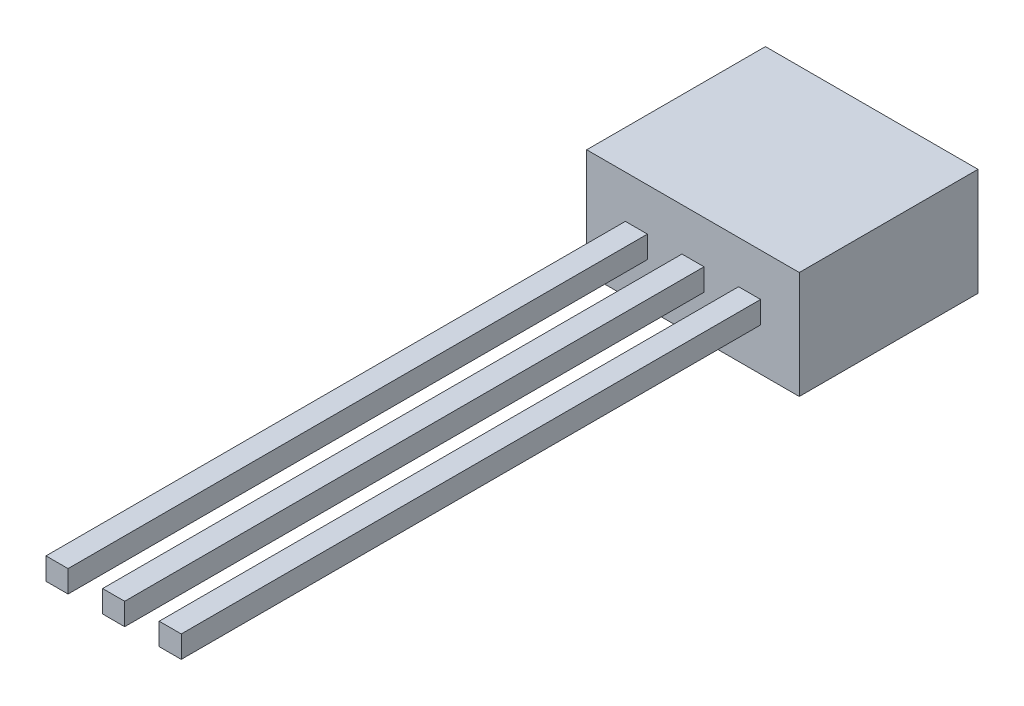
ISO-10303-21;
HEADER;
FILE_DESCRIPTION(('STEP AP214'),'2;1');
FILE_NAME('part.step','',(''),(''),'','','');
FILE_SCHEMA(('AUTOMOTIVE_DESIGN { 1 0 10303 214 1 1 1 1 }'));
ENDSEC;
DATA;
#1=APPLICATION_CONTEXT('core data for automotive mechanical design processes');
#2=APPLICATION_PROTOCOL_DEFINITION('international standard','automotive_design',2000,#1);
#3=PRODUCT_CONTEXT('',#1,'mechanical');
#4=PRODUCT('Part','Part','',(#3));
#5=PRODUCT_RELATED_PRODUCT_CATEGORY('part','',(#4));
#6=PRODUCT_DEFINITION_FORMATION('','',#4);
#7=PRODUCT_DEFINITION_CONTEXT('part definition',#1,'design');
#8=PRODUCT_DEFINITION('design','',#6,#7);
#9=PRODUCT_DEFINITION_SHAPE('','',#8);
#10=(LENGTH_UNIT() NAMED_UNIT(*) SI_UNIT(.MILLI.,.METRE.));
#11=(NAMED_UNIT(*) PLANE_ANGLE_UNIT() SI_UNIT($,.RADIAN.));
#12=(NAMED_UNIT(*) SI_UNIT($,.STERADIAN.) SOLID_ANGLE_UNIT());
#13=UNCERTAINTY_MEASURE_WITH_UNIT(LENGTH_MEASURE(1.E-05),#10,'distance_accuracy_value','');
#14=(GEOMETRIC_REPRESENTATION_CONTEXT(3) GLOBAL_UNCERTAINTY_ASSIGNED_CONTEXT((#13)) GLOBAL_UNIT_ASSIGNED_CONTEXT((#10,
#11,#12)) REPRESENTATION_CONTEXT('',''));
#15=CARTESIAN_POINT('',(0.,0.,0.));
#16=DIRECTION('',(0.,0.,1.));
#17=DIRECTION('',(1.,0.,0.));
#18=AXIS2_PLACEMENT_3D('',#15,#16,#17);
#19=CARTESIAN_POINT('',(0.,2.41,4.01));
#20=DIRECTION('',(0.,0.,-1.));
#21=DIRECTION('',(-1.,0.,0.));
#22=AXIS2_PLACEMENT_3D('',#19,#20,#21);
#23=PLANE('',#22);
#24=DIRECTION('',(1.,0.,0.));
#25=VECTOR('',#24,1.);
#26=CARTESIAN_POINT('',(3.4075,0.9575,4.01));
#27=LINE('',#26,#25);
#28=CARTESIAN_POINT('',(3.4075,0.9575,4.01));
#29=VERTEX_POINT('',#28);
#30=CARTESIAN_POINT('',(3.9025,0.9575,4.01));
#31=VERTEX_POINT('',#30);
#32=EDGE_CURVE('E170',#29,#31,#27,.T.);
#33=ORIENTED_EDGE('',*,*,#32,.F.);
#34=DIRECTION('',(0.,-1.,0.));
#35=VECTOR('',#34,1.);
#36=CARTESIAN_POINT('',(3.4075,1.4525,4.01));
#37=LINE('',#36,#35);
#38=CARTESIAN_POINT('',(3.4075,1.4525,4.01));
#39=VERTEX_POINT('',#38);
#40=EDGE_CURVE('E183',#39,#29,#37,.T.);
#41=ORIENTED_EDGE('',*,*,#40,.F.);
#42=DIRECTION('',(-1.,0.,0.));
#43=VECTOR('',#42,1.);
#44=CARTESIAN_POINT('',(3.4075,1.4525,4.01));
#45=LINE('',#44,#43);
#46=CARTESIAN_POINT('',(3.9025,1.4525,4.01));
#47=VERTEX_POINT('',#46);
#48=EDGE_CURVE('E192',#47,#39,#45,.T.);
#49=ORIENTED_EDGE('',*,*,#48,.F.);
#50=DIRECTION('',(0.,1.,0.));
#51=VECTOR('',#50,1.);
#52=CARTESIAN_POINT('',(3.9025,1.4525,4.01));
#53=LINE('',#52,#51);
#54=EDGE_CURVE('E173',#31,#47,#53,.T.);
#55=ORIENTED_EDGE('',*,*,#54,.F.);
#56=EDGE_LOOP('',(#33,#41,#49,#55));
#57=FACE_BOUND('',#56,.T.);
#58=DIRECTION('',(1.,0.,0.));
#59=VECTOR('',#58,1.);
#60=CARTESIAN_POINT('',(0.,0.,4.01));
#61=LINE('',#60,#59);
#62=CARTESIAN_POINT('',(0.,0.,4.01));
#63=VERTEX_POINT('',#62);
#64=CARTESIAN_POINT('',(4.77,0.,4.01));
#65=VERTEX_POINT('',#64);
#66=EDGE_CURVE('E255',#63,#65,#61,.T.);
#67=ORIENTED_EDGE('',*,*,#66,.T.);
#68=DIRECTION('',(0.,-1.,0.));
#69=VECTOR('',#68,1.);
#70=CARTESIAN_POINT('',(4.77,2.41,4.01));
#71=LINE('',#70,#69);
#72=CARTESIAN_POINT('',(4.77,2.41,4.01));
#73=VERTEX_POINT('',#72);
#74=EDGE_CURVE('E44',#73,#65,#71,.T.);
#75=ORIENTED_EDGE('',*,*,#74,.F.);
#76=DIRECTION('',(1.,0.,0.));
#77=VECTOR('',#76,1.);
#78=CARTESIAN_POINT('',(0.,2.41,4.01));
#79=LINE('',#78,#77);
#80=CARTESIAN_POINT('',(0.,2.41,4.01));
#81=VERTEX_POINT('',#80);
#82=EDGE_CURVE('E245',#81,#73,#79,.T.);
#83=ORIENTED_EDGE('',*,*,#82,.F.);
#84=DIRECTION('',(0.,-1.,0.));
#85=VECTOR('',#84,1.);
#86=CARTESIAN_POINT('',(0.,2.41,4.01));
#87=LINE('',#86,#85);
#88=EDGE_CURVE('E11',#81,#63,#87,.T.);
#89=ORIENTED_EDGE('',*,*,#88,.T.);
#90=EDGE_LOOP('',(#67,#75,#83,#89));
#91=FACE_BOUND('',#90,.T.);
#92=DIRECTION('',(0.,1.,0.));
#93=VECTOR('',#92,1.);
#94=CARTESIAN_POINT('',(2.6325,1.4525,4.01));
#95=LINE('',#94,#93);
#96=CARTESIAN_POINT('',(2.6325,0.9575,4.01));
#97=VERTEX_POINT('',#96);
#98=CARTESIAN_POINT('',(2.6325,1.4525,4.01));
#99=VERTEX_POINT('',#98);
#100=EDGE_CURVE('E208',#97,#99,#95,.T.);
#101=ORIENTED_EDGE('',*,*,#100,.F.);
#102=DIRECTION('',(1.,0.,0.));
#103=VECTOR('',#102,1.);
#104=CARTESIAN_POINT('',(2.1375,0.9575,4.01));
#105=LINE('',#104,#103);
#106=CARTESIAN_POINT('',(2.1375,0.9575,4.01));
#107=VERTEX_POINT('',#106);
#108=EDGE_CURVE('E213',#107,#97,#105,.T.);
#109=ORIENTED_EDGE('',*,*,#108,.F.);
#110=DIRECTION('',(0.,-1.,0.));
#111=VECTOR('',#110,1.);
#112=CARTESIAN_POINT('',(2.1375,1.4525,4.01));
#113=LINE('',#112,#111);
#114=CARTESIAN_POINT('',(2.1375,1.4525,4.01));
#115=VERTEX_POINT('',#114);
#116=EDGE_CURVE('E225',#115,#107,#113,.T.);
#117=ORIENTED_EDGE('',*,*,#116,.F.);
#118=DIRECTION('',(-1.,0.,0.));
#119=VECTOR('',#118,1.);
#120=CARTESIAN_POINT('',(2.1375,1.4525,4.01));
#121=LINE('',#120,#119);
#122=EDGE_CURVE('E222',#99,#115,#121,.T.);
#123=ORIENTED_EDGE('',*,*,#122,.F.);
#124=EDGE_LOOP('',(#101,#109,#117,#123));
#125=FACE_BOUND('',#124,.T.);
#126=DIRECTION('',(1.,0.,0.));
#127=VECTOR('',#126,1.);
#128=CARTESIAN_POINT('',(0.867500000000001,0.957499999999991,4.01));
#129=LINE('',#128,#127);
#130=CARTESIAN_POINT('',(0.867500000000001,0.957499999999991,4.01));
#131=VERTEX_POINT('',#130);
#132=CARTESIAN_POINT('',(1.3625,0.957499999999991,4.01));
#133=VERTEX_POINT('',#132);
#134=EDGE_CURVE('E169',#131,#133,#129,.T.);
#135=ORIENTED_EDGE('',*,*,#134,.F.);
#136=DIRECTION('',(0.,-1.,0.));
#137=VECTOR('',#136,1.);
#138=CARTESIAN_POINT('',(0.867500000000001,1.45249999999999,4.01));
#139=LINE('',#138,#137);
#140=CARTESIAN_POINT('',(0.867500000000001,1.45249999999999,4.01));
#141=VERTEX_POINT('',#140);
#142=EDGE_CURVE('E166',#141,#131,#139,.T.);
#143=ORIENTED_EDGE('',*,*,#142,.F.);
#144=DIRECTION('',(-1.,0.,0.));
#145=VECTOR('',#144,1.);
#146=CARTESIAN_POINT('',(0.867500000000001,1.45249999999999,4.01));
#147=LINE('',#146,#145);
#148=CARTESIAN_POINT('',(1.3625,1.45249999999999,4.01));
#149=VERTEX_POINT('',#148);
#150=EDGE_CURVE('E56',#149,#141,#147,.T.);
#151=ORIENTED_EDGE('',*,*,#150,.F.);
#152=DIRECTION('',(0.,1.,0.));
#153=VECTOR('',#152,1.);
#154=CARTESIAN_POINT('',(1.3625,1.45249999999999,4.01));
#155=LINE('',#154,#153);
#156=EDGE_CURVE('E51',#133,#149,#155,.T.);
#157=ORIENTED_EDGE('',*,*,#156,.F.);
#158=EDGE_LOOP('',(#135,#143,#151,#157));
#159=FACE_BOUND('',#158,.T.);
#160=ADVANCED_FACE('F36',(#57,#91,#125,#159),#23,.F.);
#161=CARTESIAN_POINT('',(0.,2.41,0.));
#162=DIRECTION('',(1.,0.,0.));
#163=DIRECTION('',(0.,0.,-1.));
#164=AXIS2_PLACEMENT_3D('',#161,#162,#163);
#165=PLANE('',#164);
#166=DIRECTION('',(0.,0.,1.));
#167=VECTOR('',#166,1.);
#168=CARTESIAN_POINT('',(0.,0.,0.));
#169=LINE('',#168,#167);
#170=CARTESIAN_POINT('',(0.,0.,0.));
#171=VERTEX_POINT('',#170);
#172=EDGE_CURVE('E241',#171,#63,#169,.T.);
#173=ORIENTED_EDGE('',*,*,#172,.T.);
#174=ORIENTED_EDGE('',*,*,#88,.F.);
#175=DIRECTION('',(0.,0.,1.));
#176=VECTOR('',#175,1.);
#177=CARTESIAN_POINT('',(0.,2.41,0.));
#178=LINE('',#177,#176);
#179=CARTESIAN_POINT('',(0.,2.41,0.));
#180=VERTEX_POINT('',#179);
#181=EDGE_CURVE('E242',#180,#81,#178,.T.);
#182=ORIENTED_EDGE('',*,*,#181,.F.);
#183=DIRECTION('',(0.,-1.,0.));
#184=VECTOR('',#183,1.);
#185=CARTESIAN_POINT('',(0.,2.41,0.));
#186=LINE('',#185,#184);
#187=EDGE_CURVE('E252',#180,#171,#186,.T.);
#188=ORIENTED_EDGE('',*,*,#187,.T.);
#189=EDGE_LOOP('',(#173,#174,#182,#188));
#190=FACE_BOUND('',#189,.T.);
#191=ADVANCED_FACE('F38',(#190),#165,.F.);
#192=CARTESIAN_POINT('',(4.77,2.41,0.));
#193=DIRECTION('',(-1.,0.,0.));
#194=DIRECTION('',(0.,0.,1.));
#195=AXIS2_PLACEMENT_3D('',#192,#193,#194);
#196=PLANE('',#195);
#197=DIRECTION('',(0.,0.,-1.));
#198=VECTOR('',#197,1.);
#199=CARTESIAN_POINT('',(4.77,0.,0.));
#200=LINE('',#199,#198);
#201=CARTESIAN_POINT('',(4.77,0.,0.));
#202=VERTEX_POINT('',#201);
#203=EDGE_CURVE('E257',#65,#202,#200,.T.);
#204=ORIENTED_EDGE('',*,*,#203,.T.);
#205=DIRECTION('',(0.,-1.,0.));
#206=VECTOR('',#205,1.);
#207=CARTESIAN_POINT('',(4.77,2.41,0.));
#208=LINE('',#207,#206);
#209=CARTESIAN_POINT('',(4.77,2.41,0.));
#210=VERTEX_POINT('',#209);
#211=EDGE_CURVE('E262',#210,#202,#208,.T.);
#212=ORIENTED_EDGE('',*,*,#211,.F.);
#213=DIRECTION('',(0.,0.,-1.));
#214=VECTOR('',#213,1.);
#215=CARTESIAN_POINT('',(4.77,2.41,0.));
#216=LINE('',#215,#214);
#217=EDGE_CURVE('E248',#73,#210,#216,.T.);
#218=ORIENTED_EDGE('',*,*,#217,.F.);
#219=ORIENTED_EDGE('',*,*,#74,.T.);
#220=EDGE_LOOP('',(#204,#212,#218,#219));
#221=FACE_BOUND('',#220,.T.);
#222=ADVANCED_FACE('F269',(#221),#196,.F.);
#223=CARTESIAN_POINT('',(0.,2.41,0.));
#224=DIRECTION('',(0.,0.,1.));
#225=DIRECTION('',(1.,0.,0.));
#226=AXIS2_PLACEMENT_3D('',#223,#224,#225);
#227=PLANE('',#226);
#228=DIRECTION('',(-1.,0.,0.));
#229=VECTOR('',#228,1.);
#230=CARTESIAN_POINT('',(0.,0.,0.));
#231=LINE('',#230,#229);
#232=EDGE_CURVE('E246',#202,#171,#231,.T.);
#233=ORIENTED_EDGE('',*,*,#232,.T.);
#234=ORIENTED_EDGE('',*,*,#187,.F.);
#235=DIRECTION('',(-1.,0.,0.));
#236=VECTOR('',#235,1.);
#237=CARTESIAN_POINT('',(0.,2.41,0.));
#238=LINE('',#237,#236);
#239=EDGE_CURVE('E250',#210,#180,#238,.T.);
#240=ORIENTED_EDGE('',*,*,#239,.F.);
#241=ORIENTED_EDGE('',*,*,#211,.T.);
#242=EDGE_LOOP('',(#233,#234,#240,#241));
#243=FACE_BOUND('',#242,.T.);
#244=ADVANCED_FACE('F278',(#243),#227,.F.);
#245=CARTESIAN_POINT('',(0.,2.41,0.));
#246=DIRECTION('',(0.,1.,0.));
#247=DIRECTION('',(0.,0.,1.));
#248=AXIS2_PLACEMENT_3D('',#245,#246,#247);
#249=PLANE('',#248);
#250=ORIENTED_EDGE('',*,*,#181,.T.);
#251=ORIENTED_EDGE('',*,*,#82,.T.);
#252=ORIENTED_EDGE('',*,*,#217,.T.);
#253=ORIENTED_EDGE('',*,*,#239,.T.);
#254=EDGE_LOOP('',(#250,#251,#252,#253));
#255=FACE_BOUND('',#254,.T.);
#256=ADVANCED_FACE('F284',(#255),#249,.T.);
#257=CARTESIAN_POINT('',(0.,0.,0.));
#258=DIRECTION('',(0.,1.,0.));
#259=DIRECTION('',(0.,0.,1.));
#260=AXIS2_PLACEMENT_3D('',#257,#258,#259);
#261=PLANE('',#260);
#262=ORIENTED_EDGE('',*,*,#172,.F.);
#263=ORIENTED_EDGE('',*,*,#232,.F.);
#264=ORIENTED_EDGE('',*,*,#203,.F.);
#265=ORIENTED_EDGE('',*,*,#66,.F.);
#266=EDGE_LOOP('',(#262,#263,#264,#265));
#267=FACE_BOUND('',#266,.T.);
#268=ADVANCED_FACE('F275',(#267),#261,.F.);
#269=CARTESIAN_POINT('',(2.6325,1.4525,17.01));
#270=DIRECTION('',(-1.,0.,0.));
#271=DIRECTION('',(0.,0.,1.));
#272=AXIS2_PLACEMENT_3D('',#269,#270,#271);
#273=PLANE('',#272);
#274=ORIENTED_EDGE('',*,*,#100,.T.);
#275=DIRECTION('',(0.,0.,-1.));
#276=VECTOR('',#275,1.);
#277=CARTESIAN_POINT('',(2.6325,1.4525,17.01));
#278=LINE('',#277,#276);
#279=CARTESIAN_POINT('',(2.6325,1.4525,17.01));
#280=VERTEX_POINT('',#279);
#281=EDGE_CURVE('E238',#280,#99,#278,.T.);
#282=ORIENTED_EDGE('',*,*,#281,.F.);
#283=DIRECTION('',(0.,1.,0.));
#284=VECTOR('',#283,1.);
#285=CARTESIAN_POINT('',(2.6325,1.4525,17.01));
#286=LINE('',#285,#284);
#287=CARTESIAN_POINT('',(2.6325,0.9575,17.01));
#288=VERTEX_POINT('',#287);
#289=EDGE_CURVE('E209',#288,#280,#286,.T.);
#290=ORIENTED_EDGE('',*,*,#289,.F.);
#291=DIRECTION('',(0.,0.,-1.));
#292=VECTOR('',#291,1.);
#293=CARTESIAN_POINT('',(2.6325,0.9575,17.01));
#294=LINE('',#293,#292);
#295=EDGE_CURVE('E219',#288,#97,#294,.T.);
#296=ORIENTED_EDGE('',*,*,#295,.T.);
#297=EDGE_LOOP('',(#274,#282,#290,#296));
#298=FACE_BOUND('',#297,.T.);
#299=ADVANCED_FACE('F350',(#298),#273,.F.);
#300=CARTESIAN_POINT('',(2.1375,1.4525,17.01));
#301=DIRECTION('',(0.,-1.,0.));
#302=DIRECTION('',(0.,0.,-1.));
#303=AXIS2_PLACEMENT_3D('',#300,#301,#302);
#304=PLANE('',#303);
#305=ORIENTED_EDGE('',*,*,#122,.T.);
#306=DIRECTION('',(0.,0.,-1.));
#307=VECTOR('',#306,1.);
#308=CARTESIAN_POINT('',(2.1375,1.4525,17.01));
#309=LINE('',#308,#307);
#310=CARTESIAN_POINT('',(2.1375,1.4525,17.01));
#311=VERTEX_POINT('',#310);
#312=EDGE_CURVE('E235',#311,#115,#309,.T.);
#313=ORIENTED_EDGE('',*,*,#312,.F.);
#314=DIRECTION('',(-1.,0.,0.));
#315=VECTOR('',#314,1.);
#316=CARTESIAN_POINT('',(2.1375,1.4525,17.01));
#317=LINE('',#316,#315);
#318=EDGE_CURVE('E212',#280,#311,#317,.T.);
#319=ORIENTED_EDGE('',*,*,#318,.F.);
#320=ORIENTED_EDGE('',*,*,#281,.T.);
#321=EDGE_LOOP('',(#305,#313,#319,#320));
#322=FACE_BOUND('',#321,.T.);
#323=ADVANCED_FACE('F346',(#322),#304,.F.);
#324=CARTESIAN_POINT('',(2.1375,1.4525,17.01));
#325=DIRECTION('',(1.,0.,0.));
#326=DIRECTION('',(0.,0.,-1.));
#327=AXIS2_PLACEMENT_3D('',#324,#325,#326);
#328=PLANE('',#327);
#329=ORIENTED_EDGE('',*,*,#116,.T.);
#330=DIRECTION('',(0.,0.,-1.));
#331=VECTOR('',#330,1.);
#332=CARTESIAN_POINT('',(2.1375,0.9575,17.01));
#333=LINE('',#332,#331);
#334=CARTESIAN_POINT('',(2.1375,0.9575,17.01));
#335=VERTEX_POINT('',#334);
#336=EDGE_CURVE('E232',#335,#107,#333,.T.);
#337=ORIENTED_EDGE('',*,*,#336,.F.);
#338=DIRECTION('',(0.,-1.,0.));
#339=VECTOR('',#338,1.);
#340=CARTESIAN_POINT('',(2.1375,1.4525,17.01));
#341=LINE('',#340,#339);
#342=EDGE_CURVE('E215',#311,#335,#341,.T.);
#343=ORIENTED_EDGE('',*,*,#342,.F.);
#344=ORIENTED_EDGE('',*,*,#312,.T.);
#345=EDGE_LOOP('',(#329,#337,#343,#344));
#346=FACE_BOUND('',#345,.T.);
#347=ADVANCED_FACE('F342',(#346),#328,.F.);
#348=CARTESIAN_POINT('',(2.1375,0.9575,17.01));
#349=DIRECTION('',(0.,1.,0.));
#350=DIRECTION('',(0.,0.,1.));
#351=AXIS2_PLACEMENT_3D('',#348,#349,#350);
#352=PLANE('',#351);
#353=ORIENTED_EDGE('',*,*,#108,.T.);
#354=ORIENTED_EDGE('',*,*,#295,.F.);
#355=DIRECTION('',(1.,0.,0.));
#356=VECTOR('',#355,1.);
#357=CARTESIAN_POINT('',(2.1375,0.9575,17.01));
#358=LINE('',#357,#356);
#359=EDGE_CURVE('E217',#335,#288,#358,.T.);
#360=ORIENTED_EDGE('',*,*,#359,.F.);
#361=ORIENTED_EDGE('',*,*,#336,.T.);
#362=EDGE_LOOP('',(#353,#354,#360,#361));
#363=FACE_BOUND('',#362,.T.);
#364=ADVANCED_FACE('F338',(#363),#352,.F.);
#365=CARTESIAN_POINT('',(0.,0.,17.01));
#366=DIRECTION('',(0.,0.,1.));
#367=DIRECTION('',(1.,0.,0.));
#368=AXIS2_PLACEMENT_3D('',#365,#366,#367);
#369=PLANE('',#368);
#370=ORIENTED_EDGE('',*,*,#289,.T.);
#371=ORIENTED_EDGE('',*,*,#318,.T.);
#372=ORIENTED_EDGE('',*,*,#342,.T.);
#373=ORIENTED_EDGE('',*,*,#359,.T.);
#374=EDGE_LOOP('',(#370,#371,#372,#373));
#375=FACE_BOUND('',#374,.T.);
#376=ADVANCED_FACE('F334',(#375),#369,.T.);
#377=CARTESIAN_POINT('',(3.4075,0.9575,17.01));
#378=DIRECTION('',(0.,1.,0.));
#379=DIRECTION('',(0.,0.,1.));
#380=AXIS2_PLACEMENT_3D('',#377,#378,#379);
#381=PLANE('',#380);
#382=ORIENTED_EDGE('',*,*,#32,.T.);
#383=DIRECTION('',(0.,0.,-1.));
#384=VECTOR('',#383,1.);
#385=CARTESIAN_POINT('',(3.9025,0.9575,17.01));
#386=LINE('',#385,#384);
#387=CARTESIAN_POINT('',(3.9025,0.9575,17.01));
#388=VERTEX_POINT('',#387);
#389=EDGE_CURVE('E205',#388,#31,#386,.T.);
#390=ORIENTED_EDGE('',*,*,#389,.F.);
#391=DIRECTION('',(1.,0.,0.));
#392=VECTOR('',#391,1.);
#393=CARTESIAN_POINT('',(3.4075,0.9575,17.01));
#394=LINE('',#393,#392);
#395=CARTESIAN_POINT('',(3.4075,0.9575,17.01));
#396=VERTEX_POINT('',#395);
#397=EDGE_CURVE('E179',#396,#388,#394,.T.);
#398=ORIENTED_EDGE('',*,*,#397,.F.);
#399=DIRECTION('',(0.,0.,-1.));
#400=VECTOR('',#399,1.);
#401=CARTESIAN_POINT('',(3.4075,0.9575,17.01));
#402=LINE('',#401,#400);
#403=EDGE_CURVE('E188',#396,#29,#402,.T.);
#404=ORIENTED_EDGE('',*,*,#403,.T.);
#405=EDGE_LOOP('',(#382,#390,#398,#404));
#406=FACE_BOUND('',#405,.T.);
#407=ADVANCED_FACE('F330',(#406),#381,.F.);
#408=CARTESIAN_POINT('',(3.9025,1.4525,17.01));
#409=DIRECTION('',(-1.,0.,0.));
#410=DIRECTION('',(0.,0.,1.));
#411=AXIS2_PLACEMENT_3D('',#408,#409,#410);
#412=PLANE('',#411);
#413=ORIENTED_EDGE('',*,*,#54,.T.);
#414=DIRECTION('',(0.,0.,-1.));
#415=VECTOR('',#414,1.);
#416=CARTESIAN_POINT('',(3.9025,1.4525,17.01));
#417=LINE('',#416,#415);
#418=CARTESIAN_POINT('',(3.9025,1.4525,17.01));
#419=VERTEX_POINT('',#418);
#420=EDGE_CURVE('E202',#419,#47,#417,.T.);
#421=ORIENTED_EDGE('',*,*,#420,.F.);
#422=DIRECTION('',(0.,1.,0.));
#423=VECTOR('',#422,1.);
#424=CARTESIAN_POINT('',(3.9025,1.4525,17.01));
#425=LINE('',#424,#423);
#426=EDGE_CURVE('E182',#388,#419,#425,.T.);
#427=ORIENTED_EDGE('',*,*,#426,.F.);
#428=ORIENTED_EDGE('',*,*,#389,.T.);
#429=EDGE_LOOP('',(#413,#421,#427,#428));
#430=FACE_BOUND('',#429,.T.);
#431=ADVANCED_FACE('F326',(#430),#412,.F.);
#432=CARTESIAN_POINT('',(3.4075,1.4525,17.01));
#433=DIRECTION('',(0.,-1.,0.));
#434=DIRECTION('',(0.,0.,-1.));
#435=AXIS2_PLACEMENT_3D('',#432,#433,#434);
#436=PLANE('',#435);
#437=ORIENTED_EDGE('',*,*,#48,.T.);
#438=DIRECTION('',(0.,0.,-1.));
#439=VECTOR('',#438,1.);
#440=CARTESIAN_POINT('',(3.4075,1.4525,17.01));
#441=LINE('',#440,#439);
#442=CARTESIAN_POINT('',(3.4075,1.4525,17.01));
#443=VERTEX_POINT('',#442);
#444=EDGE_CURVE('E199',#443,#39,#441,.T.);
#445=ORIENTED_EDGE('',*,*,#444,.F.);
#446=DIRECTION('',(-1.,0.,0.));
#447=VECTOR('',#446,1.);
#448=CARTESIAN_POINT('',(3.4075,1.4525,17.01));
#449=LINE('',#448,#447);
#450=EDGE_CURVE('E185',#419,#443,#449,.T.);
#451=ORIENTED_EDGE('',*,*,#450,.F.);
#452=ORIENTED_EDGE('',*,*,#420,.T.);
#453=EDGE_LOOP('',(#437,#445,#451,#452));
#454=FACE_BOUND('',#453,.T.);
#455=ADVANCED_FACE('F322',(#454),#436,.F.);
#456=CARTESIAN_POINT('',(3.4075,1.4525,17.01));
#457=DIRECTION('',(1.,0.,0.));
#458=DIRECTION('',(0.,0.,-1.));
#459=AXIS2_PLACEMENT_3D('',#456,#457,#458);
#460=PLANE('',#459);
#461=ORIENTED_EDGE('',*,*,#40,.T.);
#462=ORIENTED_EDGE('',*,*,#403,.F.);
#463=DIRECTION('',(0.,-1.,0.));
#464=VECTOR('',#463,1.);
#465=CARTESIAN_POINT('',(3.4075,1.4525,17.01));
#466=LINE('',#465,#464);
#467=EDGE_CURVE('E187',#443,#396,#466,.T.);
#468=ORIENTED_EDGE('',*,*,#467,.F.);
#469=ORIENTED_EDGE('',*,*,#444,.T.);
#470=EDGE_LOOP('',(#461,#462,#468,#469));
#471=FACE_BOUND('',#470,.T.);
#472=ADVANCED_FACE('F318',(#471),#460,.F.);
#473=CARTESIAN_POINT('',(0.,0.,17.01));
#474=DIRECTION('',(0.,0.,-1.));
#475=DIRECTION('',(-1.,0.,0.));
#476=AXIS2_PLACEMENT_3D('',#473,#474,#475);
#477=PLANE('',#476);
#478=ORIENTED_EDGE('',*,*,#397,.T.);
#479=ORIENTED_EDGE('',*,*,#426,.T.);
#480=ORIENTED_EDGE('',*,*,#450,.T.);
#481=ORIENTED_EDGE('',*,*,#467,.T.);
#482=EDGE_LOOP('',(#478,#479,#480,#481));
#483=FACE_BOUND('',#482,.T.);
#484=ADVANCED_FACE('F315',(#483),#477,.F.);
#485=CARTESIAN_POINT('',(0.867500000000001,0.957499999999991,17.01));
#486=DIRECTION('',(0.,1.,0.));
#487=DIRECTION('',(0.,0.,1.));
#488=AXIS2_PLACEMENT_3D('',#485,#486,#487);
#489=PLANE('',#488);
#490=ORIENTED_EDGE('',*,*,#134,.T.);
#491=DIRECTION('',(0.,0.,-1.));
#492=VECTOR('',#491,1.);
#493=CARTESIAN_POINT('',(1.3625,0.957499999999991,17.01));
#494=LINE('',#493,#492);
#495=CARTESIAN_POINT('',(1.3625,0.957499999999991,17.01));
#496=VERTEX_POINT('',#495);
#497=EDGE_CURVE('E150',#496,#133,#494,.T.);
#498=ORIENTED_EDGE('',*,*,#497,.F.);
#499=DIRECTION('',(1.,0.,0.));
#500=VECTOR('',#499,1.);
#501=CARTESIAN_POINT('',(0.867500000000001,0.957499999999991,17.01));
#502=LINE('',#501,#500);
#503=CARTESIAN_POINT('',(0.867500000000001,0.957499999999991,17.01));
#504=VERTEX_POINT('',#503);
#505=EDGE_CURVE('E157',#504,#496,#502,.T.);
#506=ORIENTED_EDGE('',*,*,#505,.F.);
#507=DIRECTION('',(0.,0.,-1.));
#508=VECTOR('',#507,1.);
#509=CARTESIAN_POINT('',(0.867500000000001,0.957499999999991,17.01));
#510=LINE('',#509,#508);
#511=EDGE_CURVE('E293',#504,#131,#510,.T.);
#512=ORIENTED_EDGE('',*,*,#511,.T.);
#513=EDGE_LOOP('',(#490,#498,#506,#512));
#514=FACE_BOUND('',#513,.T.);
#515=ADVANCED_FACE('F168',(#514),#489,.F.);
#516=CARTESIAN_POINT('',(1.3625,1.45249999999999,17.01));
#517=DIRECTION('',(-1.,0.,0.));
#518=DIRECTION('',(0.,0.,1.));
#519=AXIS2_PLACEMENT_3D('',#516,#517,#518);
#520=PLANE('',#519);
#521=ORIENTED_EDGE('',*,*,#156,.T.);
#522=DIRECTION('',(0.,0.,-1.));
#523=VECTOR('',#522,1.);
#524=CARTESIAN_POINT('',(1.3625,1.45249999999999,17.01));
#525=LINE('',#524,#523);
#526=CARTESIAN_POINT('',(1.3625,1.45249999999999,17.01));
#527=VERTEX_POINT('',#526);
#528=EDGE_CURVE('E153',#527,#149,#525,.T.);
#529=ORIENTED_EDGE('',*,*,#528,.F.);
#530=DIRECTION('',(0.,1.,0.));
#531=VECTOR('',#530,1.);
#532=CARTESIAN_POINT('',(1.3625,1.45249999999999,17.01));
#533=LINE('',#532,#531);
#534=EDGE_CURVE('E146',#496,#527,#533,.T.);
#535=ORIENTED_EDGE('',*,*,#534,.F.);
#536=ORIENTED_EDGE('',*,*,#497,.T.);
#537=EDGE_LOOP('',(#521,#529,#535,#536));
#538=FACE_BOUND('',#537,.T.);
#539=ADVANCED_FACE('F148',(#538),#520,.F.);
#540=CARTESIAN_POINT('',(0.867500000000001,1.45249999999999,17.01));
#541=DIRECTION('',(0.,-1.,0.));
#542=DIRECTION('',(0.,0.,-1.));
#543=AXIS2_PLACEMENT_3D('',#540,#541,#542);
#544=PLANE('',#543);
#545=ORIENTED_EDGE('',*,*,#150,.T.);
#546=DIRECTION('',(0.,0.,-1.));
#547=VECTOR('',#546,1.);
#548=CARTESIAN_POINT('',(0.867500000000001,1.45249999999999,17.01));
#549=LINE('',#548,#547);
#550=CARTESIAN_POINT('',(0.867500000000001,1.45249999999999,17.01));
#551=VERTEX_POINT('',#550);
#552=EDGE_CURVE('E175',#551,#141,#549,.T.);
#553=ORIENTED_EDGE('',*,*,#552,.F.);
#554=DIRECTION('',(-1.,0.,0.));
#555=VECTOR('',#554,1.);
#556=CARTESIAN_POINT('',(0.867500000000001,1.45249999999999,17.01));
#557=LINE('',#556,#555);
#558=EDGE_CURVE('E156',#527,#551,#557,.T.);
#559=ORIENTED_EDGE('',*,*,#558,.F.);
#560=ORIENTED_EDGE('',*,*,#528,.T.);
#561=EDGE_LOOP('',(#545,#553,#559,#560));
#562=FACE_BOUND('',#561,.T.);
#563=ADVANCED_FACE('F302',(#562),#544,.F.);
#564=CARTESIAN_POINT('',(0.867500000000001,1.45249999999999,17.01));
#565=DIRECTION('',(1.,0.,0.));
#566=DIRECTION('',(0.,0.,-1.));
#567=AXIS2_PLACEMENT_3D('',#564,#565,#566);
#568=PLANE('',#567);
#569=ORIENTED_EDGE('',*,*,#142,.T.);
#570=ORIENTED_EDGE('',*,*,#511,.F.);
#571=DIRECTION('',(0.,-1.,0.));
#572=VECTOR('',#571,1.);
#573=CARTESIAN_POINT('',(0.867500000000001,1.45249999999999,17.01));
#574=LINE('',#573,#572);
#575=EDGE_CURVE('E162',#551,#504,#574,.T.);
#576=ORIENTED_EDGE('',*,*,#575,.F.);
#577=ORIENTED_EDGE('',*,*,#552,.T.);
#578=EDGE_LOOP('',(#569,#570,#576,#577));
#579=FACE_BOUND('',#578,.T.);
#580=ADVANCED_FACE('F292',(#579),#568,.F.);
#581=CARTESIAN_POINT('',(0.,0.,17.01));
#582=DIRECTION('',(0.,0.,-1.));
#583=DIRECTION('',(-1.,0.,0.));
#584=AXIS2_PLACEMENT_3D('',#581,#582,#583);
#585=PLANE('',#584);
#586=ORIENTED_EDGE('',*,*,#505,.T.);
#587=ORIENTED_EDGE('',*,*,#534,.T.);
#588=ORIENTED_EDGE('',*,*,#558,.T.);
#589=ORIENTED_EDGE('',*,*,#575,.T.);
#590=EDGE_LOOP('',(#586,#587,#588,#589));
#591=FACE_BOUND('',#590,.T.);
#592=ADVANCED_FACE('F160',(#591),#585,.F.);
#593=CLOSED_SHELL('',(#160,#191,#222,#244,#256,#268,#299,#323,#347,#364,#376,#407,#431,#455,
#472,#484,#515,#539,#563,#580,#592));
#594=MANIFOLD_SOLID_BREP('B2',#593);
#595=ADVANCED_BREP_SHAPE_REPRESENTATION('',(#18,#594),#14);
#596=SHAPE_DEFINITION_REPRESENTATION(#9,#595);
ENDSEC;
END-ISO-10303-21;
